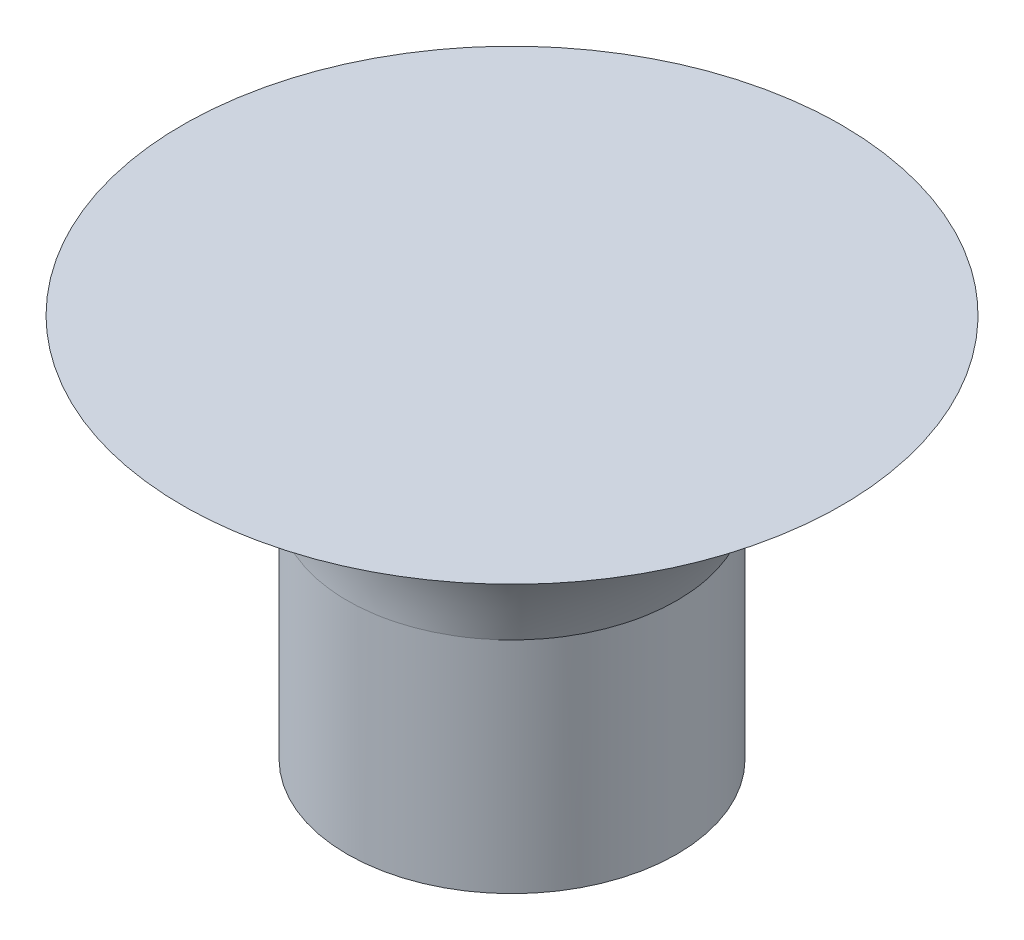
ISO-10303-21;
HEADER;
FILE_DESCRIPTION(('STEP AP214'),'2;1');
FILE_NAME('part.step','',(''),(''),'','','');
FILE_SCHEMA(('AUTOMOTIVE_DESIGN { 1 0 10303 214 1 1 1 1 }'));
ENDSEC;
DATA;
#1=APPLICATION_CONTEXT('core data for automotive mechanical design processes');
#2=APPLICATION_PROTOCOL_DEFINITION('international standard','automotive_design',2000,#1);
#3=PRODUCT_CONTEXT('',#1,'mechanical');
#4=PRODUCT('Part','Part','',(#3));
#5=PRODUCT_RELATED_PRODUCT_CATEGORY('part','',(#4));
#6=PRODUCT_DEFINITION_FORMATION('','',#4);
#7=PRODUCT_DEFINITION_CONTEXT('part definition',#1,'design');
#8=PRODUCT_DEFINITION('design','',#6,#7);
#9=PRODUCT_DEFINITION_SHAPE('','',#8);
#10=(LENGTH_UNIT() NAMED_UNIT(*) SI_UNIT(.MILLI.,.METRE.));
#11=(NAMED_UNIT(*) PLANE_ANGLE_UNIT() SI_UNIT($,.RADIAN.));
#12=(NAMED_UNIT(*) SI_UNIT($,.STERADIAN.) SOLID_ANGLE_UNIT());
#13=UNCERTAINTY_MEASURE_WITH_UNIT(LENGTH_MEASURE(1.E-05),#10,'distance_accuracy_value','');
#14=(GEOMETRIC_REPRESENTATION_CONTEXT(3) GLOBAL_UNCERTAINTY_ASSIGNED_CONTEXT((#13)) GLOBAL_UNIT_ASSIGNED_CONTEXT((#10,
#11,#12)) REPRESENTATION_CONTEXT('',''));
#15=CARTESIAN_POINT('',(0.,0.,0.));
#16=DIRECTION('',(0.,0.,1.));
#17=DIRECTION('',(1.,0.,0.));
#18=AXIS2_PLACEMENT_3D('',#15,#16,#17);
#19=CARTESIAN_POINT('',(0.,10.,0.));
#20=DIRECTION('',(0.,-1.,0.));
#21=DIRECTION('',(0.,0.,-1.));
#22=AXIS2_PLACEMENT_3D('',#19,#20,#21);
#23=CYLINDRICAL_SURFACE('',#22,7.5);
#24=CARTESIAN_POINT('',(0.,10.,-7.5));
#25=CARTESIAN_POINT('',(-0.981747696412567,10.,-7.5));
#26=CARTESIAN_POINT('',(-2.94481948994769,10.,-7.10994237281204));
#27=CARTESIAN_POINT('',(-5.44166577536165,10.,-5.44146967651622));
#28=CARTESIAN_POINT('',(-7.10969222938531,10.,-2.94495495577154));
#29=CARTESIAN_POINT('',(-7.6955531398799,10.,0.));
#30=CARTESIAN_POINT('',(-7.1096922293853,10.,2.94495495577154));
#31=CARTESIAN_POINT('',(-5.44166577536164,10.,5.44146967651626));
#32=CARTESIAN_POINT('',(-2.94481948994768,10.,7.10994237281202));
#33=CARTESIAN_POINT('',(-0.981747696412542,10.,7.5));
#34=CARTESIAN_POINT('',(0.981747696412544,10.,7.5));
#35=CARTESIAN_POINT('',(2.94481948994768,10.,7.10994237281204));
#36=CARTESIAN_POINT('',(5.44166577536163,10.,5.44146967651624));
#37=CARTESIAN_POINT('',(7.10969222938532,10.,2.94495495577155));
#38=CARTESIAN_POINT('',(7.69555313987989,10.,0.));
#39=CARTESIAN_POINT('',(7.10969222938531,10.,-2.94495495577154));
#40=CARTESIAN_POINT('',(5.44166577536164,10.,-5.44146967651626));
#41=CARTESIAN_POINT('',(2.94481948994767,10.,-7.10994237281203));
#42=CARTESIAN_POINT('',(0.981747696412519,10.,-7.5));
#43=CARTESIAN_POINT('',(0.,10.,-7.5));
#44=B_SPLINE_CURVE_WITH_KNOTS('',3,(#24,#25,#26,#27,#28,#29,#30,#31,#32,#33,#34,#35,#36,#37,#38,
#39,#40,#41,#42,#43),.UNSPECIFIED.,.T.,.F.,(4,1,1,1,1,1,1,1,2,1,1,1,1,1,1,1,4),(0.,0.0625,0.125,
0.1875,0.25,0.3125,0.375,0.4375,0.5,0.5625,0.625,0.6875,0.75,0.8125,0.875,0.9375,1.),.UNSPECIFIED.);
#45=CARTESIAN_POINT('',(0.,10.,-7.5));
#46=VERTEX_POINT('',#45);
#47=EDGE_CURVE('E10',#46,#46,#44,.T.);
#48=ORIENTED_EDGE('',*,*,#47,.F.);
#49=EDGE_LOOP('',(#48));
#50=FACE_BOUND('',#49,.T.);
#51=CARTESIAN_POINT('',(0.,0.,0.));
#52=DIRECTION('',(0.,1.,0.));
#53=DIRECTION('',(0.,0.,1.));
#54=AXIS2_PLACEMENT_3D('',#51,#52,#53);
#55=CIRCLE('',#54,7.5);
#56=CARTESIAN_POINT('',(0.,0.,7.5));
#57=VERTEX_POINT('',#56);
#58=EDGE_CURVE('E24',#57,#57,#55,.T.);
#59=ORIENTED_EDGE('',*,*,#58,.T.);
#60=EDGE_LOOP('',(#59));
#61=FACE_BOUND('',#60,.T.);
#62=ADVANCED_FACE('F15',(#50,#61),#23,.T.);
#63=CARTESIAN_POINT('',(0.,0.,0.));
#64=DIRECTION('',(0.,1.,0.));
#65=DIRECTION('',(0.,0.,1.));
#66=AXIS2_PLACEMENT_3D('',#63,#64,#65);
#67=PLANE('',#66);
#68=ORIENTED_EDGE('',*,*,#58,.F.);
#69=EDGE_LOOP('',(#68));
#70=FACE_BOUND('',#69,.T.);
#71=ADVANCED_FACE('F41',(#70),#67,.F.);
#72=CARTESIAN_POINT('',(0.,17.5,0.));
#73=DIRECTION('',(0.,1.,0.));
#74=DIRECTION('',(0.,0.,1.));
#75=AXIS2_PLACEMENT_3D('',#72,#73,#74);
#76=PLANE('',#75);
#77=CARTESIAN_POINT('',(0.,17.5,-15.));
#78=CARTESIAN_POINT('',(1.96349539282504,17.5,-15.));
#79=CARTESIAN_POINT('',(5.88974981965373,17.5,-14.219699453941));
#80=CARTESIAN_POINT('',(10.8831899638926,17.5,-10.8830057840712));
#81=CARTESIAN_POINT('',(14.2194050561288,17.5,-5.88994684071773));
#82=CARTESIAN_POINT('',(15.3910879617177,17.5,0.));
#83=CARTESIAN_POINT('',(14.2194050561288,17.5,5.88994684071774));
#84=CARTESIAN_POINT('',(10.8831899638926,17.5,10.8830057840711));
#85=CARTESIAN_POINT('',(5.88974981965377,17.5,14.219699453941));
#86=CARTESIAN_POINT('',(1.96349539282509,17.5,15.));
#87=CARTESIAN_POINT('',(-1.96349539282508,17.5,15.));
#88=CARTESIAN_POINT('',(-5.88974981965375,17.5,14.219699453941));
#89=CARTESIAN_POINT('',(-10.8831899638926,17.5,10.8830057840711));
#90=CARTESIAN_POINT('',(-14.2194050561287,17.5,5.88994684071776));
#91=CARTESIAN_POINT('',(-15.3910879617177,17.5,0.));
#92=CARTESIAN_POINT('',(-14.2194050561288,17.5,-5.88994684071771));
#93=CARTESIAN_POINT('',(-10.8831899638927,17.5,-10.8830057840711));
#94=CARTESIAN_POINT('',(-5.88974981965379,17.5,-14.219699453941));
#95=CARTESIAN_POINT('',(-1.96349539282514,17.5,-15.));
#96=CARTESIAN_POINT('',(0.,17.5,-15.));
#97=B_SPLINE_CURVE_WITH_KNOTS('',3,(#77,#78,#79,#80,#81,#82,#83,#84,#85,#86,#87,#88,#89,#90,#91,
#92,#93,#94,#95,#96),.UNSPECIFIED.,.T.,.F.,(4,1,1,1,1,1,1,1,2,1,1,1,1,1,1,1,4),(0.,0.0625,0.125,
0.1875,0.25,0.3125,0.375,0.4375,0.5,0.5625,0.625,0.6875,0.75,0.8125,0.875,0.9375,1.),.UNSPECIFIED.);
#98=CARTESIAN_POINT('',(0.,17.5,-15.));
#99=VERTEX_POINT('',#98);
#100=EDGE_CURVE('E29',#99,#99,#97,.F.);
#101=ORIENTED_EDGE('',*,*,#100,.T.);
#102=EDGE_LOOP('',(#101));
#103=FACE_BOUND('',#102,.T.);
#104=ADVANCED_FACE('F47',(#103),#76,.T.);
#105=CARTESIAN_POINT('',(0.,10.,-7.5));
#106=CARTESIAN_POINT('',(0.,14.7527594851139,-7.5));
#107=CARTESIAN_POINT('',(0.,17.252759485114,-10.));
#108=CARTESIAN_POINT('',(0.,17.5,-15.));
#109=CARTESIAN_POINT('',(-0.981747696412567,10.,-7.5));
#110=CARTESIAN_POINT('',(-1.30899692855004,14.7527594851139,-7.5));
#111=CARTESIAN_POINT('',(-1.63624616068756,17.252759485114,-10.));
#112=CARTESIAN_POINT('',(-1.96349539282514,17.5,-15.));
#113=CARTESIAN_POINT('',(-2.94481948994769,10.,-7.10994237281204));
#114=CARTESIAN_POINT('',(-3.92646293318301,14.752759485114,-7.13611139985502));
#115=CARTESIAN_POINT('',(-4.90810637641837,17.2527594851141,-9.50603042689785));
#116=CARTESIAN_POINT('',(-5.88974981965379,17.5,-14.219699453941));
#117=CARTESIAN_POINT('',(-5.44166577536165,10.,-5.44146967651622));
#118=CARTESIAN_POINT('',(-7.25550717153861,14.7527594851147,-5.49750254570112));
#119=CARTESIAN_POINT('',(-9.06934856771561,17.2527594851148,-7.31134791488534));
#120=CARTESIAN_POINT('',(-10.8831899638927,17.5,-10.8830057840711));
#121=CARTESIAN_POINT('',(-7.10969222938531,10.,-2.94495495577154));
#122=CARTESIAN_POINT('',(-9.47959650496642,14.7527594851154,-2.98911891742018));
#123=CARTESIAN_POINT('',(-11.8495007805476,17.2527594851154,-3.97078287906738));
#124=CARTESIAN_POINT('',(-14.2194050561288,17.5,-5.88994684071771));
#125=CARTESIAN_POINT('',(-7.6955531398799,10.,0.));
#126=CARTESIAN_POINT('',(-10.2607314138258,14.7527594851163,1.42211184957682E-13));
#127=CARTESIAN_POINT('',(-12.8259096877717,17.2527594851164,2.5819551936294E-12));
#128=CARTESIAN_POINT('',(-15.3910879617177,17.5,0.));
#129=CARTESIAN_POINT('',(-7.1096922293853,10.,2.94495495577154));
#130=CARTESIAN_POINT('',(-9.47959650496642,14.7527594851172,2.98911891742044));
#131=CARTESIAN_POINT('',(-11.8495007805476,17.2527594851173,3.97078287907254));
#132=CARTESIAN_POINT('',(-14.2194050561287,17.5,5.88994684071776));
#133=CARTESIAN_POINT('',(-5.44166577536164,10.,5.44146967651626));
#134=CARTESIAN_POINT('',(-7.25550717153861,14.752759485118,5.49750254570141));
#135=CARTESIAN_POINT('',(-9.06934856771562,17.2527594851181,7.31134791489051));
#136=CARTESIAN_POINT('',(-10.8831899638926,17.5,10.8830057840711));
#137=CARTESIAN_POINT('',(-2.94481948994768,10.,7.10994237281202));
#138=CARTESIAN_POINT('',(-3.92646293318302,14.7527594851185,7.13611139985525));
#139=CARTESIAN_POINT('',(-4.90810637641839,17.2527594851186,9.50603042690295));
#140=CARTESIAN_POINT('',(-5.88974981965375,17.5,14.219699453941));
#141=CARTESIAN_POINT('',(-0.981747696412542,10.,7.5));
#142=CARTESIAN_POINT('',(-1.30899692855004,14.7527594851187,7.50000000000024));
#143=CARTESIAN_POINT('',(-1.63624616068757,17.2527594851188,10.0000000000051));
#144=CARTESIAN_POINT('',(-1.96349539282508,17.5,15.));
#145=CARTESIAN_POINT('',(0.981747696412544,10.,7.5));
#146=CARTESIAN_POINT('',(1.30899692855007,14.7527594851187,7.50000000000024));
#147=CARTESIAN_POINT('',(1.63624616068758,17.2527594851188,10.0000000000051));
#148=CARTESIAN_POINT('',(1.96349539282509,17.5,15.));
#149=CARTESIAN_POINT('',(2.94481948994768,10.,7.10994237281204));
#150=CARTESIAN_POINT('',(3.92646293318306,14.7527594851185,7.13611139985526));
#151=CARTESIAN_POINT('',(4.90810637641841,17.2527594851186,9.50603042690296));
#152=CARTESIAN_POINT('',(5.88974981965377,17.5,14.219699453941));
#153=CARTESIAN_POINT('',(5.44166577536163,10.,5.44146967651624));
#154=CARTESIAN_POINT('',(7.25550717153865,14.752759485118,5.49750254570139));
#155=CARTESIAN_POINT('',(9.06934856771565,17.2527594851181,7.3113479148905));
#156=CARTESIAN_POINT('',(10.8831899638926,17.5,10.8830057840711));
#157=CARTESIAN_POINT('',(7.10969222938532,10.,2.94495495577155));
#158=CARTESIAN_POINT('',(9.4795965049665,14.7527594851172,2.98911891742044));
#159=CARTESIAN_POINT('',(11.8495007805476,17.2527594851173,3.97078287907252));
#160=CARTESIAN_POINT('',(14.2194050561288,17.5,5.88994684071774));
#161=CARTESIAN_POINT('',(7.69555313987989,10.,0.));
#162=CARTESIAN_POINT('',(10.2607314138259,14.7527594851163,0.));
#163=CARTESIAN_POINT('',(12.8259096877718,17.2527594851163,2.52720298391888E-12));
#164=CARTESIAN_POINT('',(15.3910879617177,17.5,0.));
#165=CARTESIAN_POINT('',(7.10969222938531,10.,-2.94495495577154));
#166=CARTESIAN_POINT('',(9.4795965049665,14.7527594851154,-2.98911891742021));
#167=CARTESIAN_POINT('',(11.8495007805476,17.2527594851155,-3.97078287906742));
#168=CARTESIAN_POINT('',(14.2194050561288,17.5,-5.88994684071773));
#169=CARTESIAN_POINT('',(5.44166577536164,10.,-5.44146967651626));
#170=CARTESIAN_POINT('',(7.25550717153868,14.7527594851147,-5.4975025457012));
#171=CARTESIAN_POINT('',(9.06934856771568,17.2527594851147,-7.31134791488545));
#172=CARTESIAN_POINT('',(10.8831899638926,17.5,-10.8830057840712));
#173=CARTESIAN_POINT('',(2.94481948994767,10.,-7.10994237281203));
#174=CARTESIAN_POINT('',(3.92646293318307,14.7527594851141,-7.13611139985501));
#175=CARTESIAN_POINT('',(4.90810637641843,17.2527594851141,-9.50603042689785));
#176=CARTESIAN_POINT('',(5.88974981965373,17.5,-14.219699453941));
#177=CARTESIAN_POINT('',(0.981747696412519,10.,-7.5));
#178=CARTESIAN_POINT('',(1.30899692855008,14.7527594851139,-7.5));
#179=CARTESIAN_POINT('',(1.63624616068759,17.252759485114,-10.));
#180=CARTESIAN_POINT('',(1.96349539282504,17.5,-15.));
#181=CARTESIAN_POINT('',(0.,10.,-7.5));
#182=CARTESIAN_POINT('',(0.,14.7527594851139,-7.5));
#183=CARTESIAN_POINT('',(0.,17.252759485114,-10.));
#184=CARTESIAN_POINT('',(0.,17.5,-15.));
#185=B_SPLINE_SURFACE_WITH_KNOTS('',3,3,((#105,#106,#107,#108),(#109,#110,#111,#112),(#113,#114,
#115,#116),(#117,#118,#119,#120),(#121,#122,#123,#124),(#125,#126,#127,#128),(#129,#130,#131,
#132),(#133,#134,#135,#136),(#137,#138,#139,#140),(#141,#142,#143,#144),(#145,#146,#147,#148),
(#149,#150,#151,#152),(#153,#154,#155,#156),(#157,#158,#159,#160),(#161,#162,#163,#164),(#165,
#166,#167,#168),(#169,#170,#171,#172),(#173,#174,#175,#176),(#177,#178,#179,#180),(#181,#182,
#183,#184)),.UNSPECIFIED.,.T.,.F.,.F.,(4,1,1,1,1,1,1,1,2,1,1,1,1,1,1,1,4),(4,4),(0.,0.0625,
0.125,0.1875,0.25,0.3125,0.375,0.4375,0.5,0.5625,0.625,0.6875,0.75,0.8125,0.875,0.9375,1.),(0.,
1.),.UNSPECIFIED.);
#186=ORIENTED_EDGE('',*,*,#47,.T.);
#187=EDGE_LOOP('',(#186));
#188=FACE_BOUND('',#187,.T.);
#189=ORIENTED_EDGE('',*,*,#100,.F.);
#190=EDGE_LOOP('',(#189));
#191=FACE_BOUND('',#190,.T.);
#192=ADVANCED_FACE('F53',(#188,#191),#185,.T.);
#193=CLOSED_SHELL('',(#62,#71,#104,#192));
#194=MANIFOLD_SOLID_BREP('B1',#193);
#195=ADVANCED_BREP_SHAPE_REPRESENTATION('',(#18,#194),#14);
#196=SHAPE_DEFINITION_REPRESENTATION(#9,#195);
ENDSEC;
END-ISO-10303-21;
